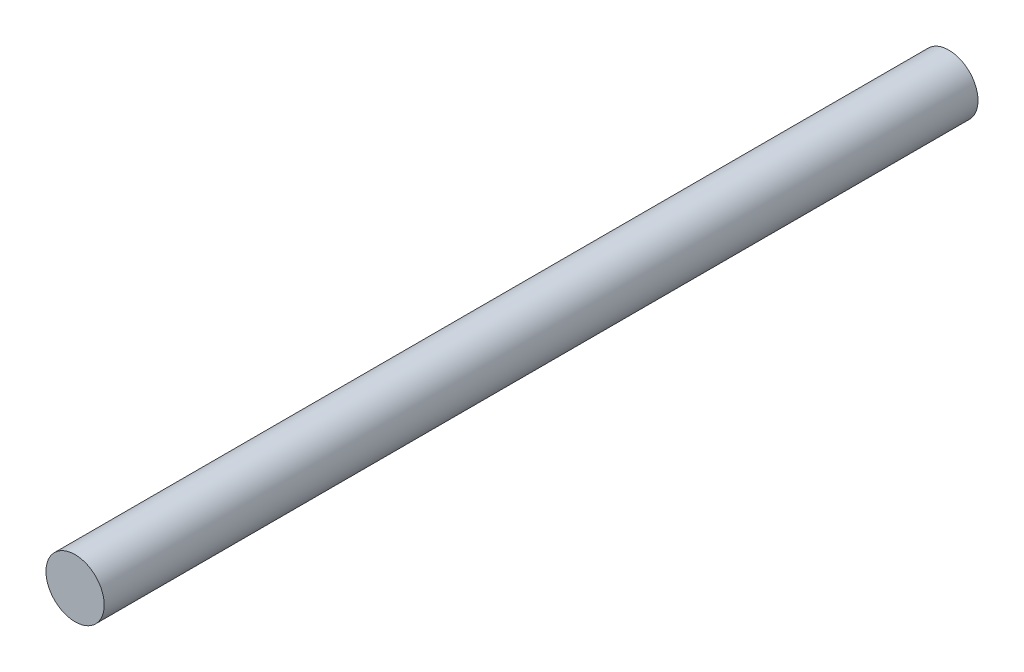
ISO-10303-21;
HEADER;
FILE_DESCRIPTION(('STEP AP214'),'2;1');
FILE_NAME('part.step','',(''),(''),'','','');
FILE_SCHEMA(('AUTOMOTIVE_DESIGN { 1 0 10303 214 1 1 1 1 }'));
ENDSEC;
DATA;
#1=APPLICATION_CONTEXT('core data for automotive mechanical design processes');
#2=APPLICATION_PROTOCOL_DEFINITION('international standard','automotive_design',2000,#1);
#3=PRODUCT_CONTEXT('',#1,'mechanical');
#4=PRODUCT('Part','Part','',(#3));
#5=PRODUCT_RELATED_PRODUCT_CATEGORY('part','',(#4));
#6=PRODUCT_DEFINITION_FORMATION('','',#4);
#7=PRODUCT_DEFINITION_CONTEXT('part definition',#1,'design');
#8=PRODUCT_DEFINITION('design','',#6,#7);
#9=PRODUCT_DEFINITION_SHAPE('','',#8);
#10=(LENGTH_UNIT() NAMED_UNIT(*) SI_UNIT(.MILLI.,.METRE.));
#11=(NAMED_UNIT(*) PLANE_ANGLE_UNIT() SI_UNIT($,.RADIAN.));
#12=(NAMED_UNIT(*) SI_UNIT($,.STERADIAN.) SOLID_ANGLE_UNIT());
#13=UNCERTAINTY_MEASURE_WITH_UNIT(LENGTH_MEASURE(1.E-05),#10,'distance_accuracy_value','');
#14=(GEOMETRIC_REPRESENTATION_CONTEXT(3) GLOBAL_UNCERTAINTY_ASSIGNED_CONTEXT((#13)) GLOBAL_UNIT_ASSIGNED_CONTEXT((#10,
#11,#12)) REPRESENTATION_CONTEXT('',''));
#15=CARTESIAN_POINT('',(0.,0.,0.));
#16=DIRECTION('',(0.,0.,1.));
#17=DIRECTION('',(1.,0.,0.));
#18=AXIS2_PLACEMENT_3D('',#15,#16,#17);
#19=CARTESIAN_POINT('',(0.,0.,750.));
#20=DIRECTION('',(0.,0.,-1.));
#21=DIRECTION('',(-1.,0.,0.));
#22=AXIS2_PLACEMENT_3D('',#19,#20,#21);
#23=CYLINDRICAL_SURFACE('',#22,50.);
#24=CARTESIAN_POINT('',(0.,0.,750.));
#25=DIRECTION('',(0.,0.,1.));
#26=DIRECTION('',(1.,0.,0.));
#27=AXIS2_PLACEMENT_3D('',#24,#25,#26);
#28=CIRCLE('',#27,50.);
#29=CARTESIAN_POINT('',(50.,0.,750.));
#30=VERTEX_POINT('',#29);
#31=EDGE_CURVE('E10',#30,#30,#28,.T.);
#32=ORIENTED_EDGE('',*,*,#31,.F.);
#33=EDGE_LOOP('',(#32));
#34=FACE_BOUND('',#33,.T.);
#35=CARTESIAN_POINT('',(0.,0.,-750.));
#36=DIRECTION('',(0.,0.,1.));
#37=DIRECTION('',(1.,0.,0.));
#38=AXIS2_PLACEMENT_3D('',#35,#36,#37);
#39=CIRCLE('',#38,50.);
#40=CARTESIAN_POINT('',(50.,0.,-750.));
#41=VERTEX_POINT('',#40);
#42=EDGE_CURVE('E36',#41,#41,#39,.T.);
#43=ORIENTED_EDGE('',*,*,#42,.T.);
#44=EDGE_LOOP('',(#43));
#45=FACE_BOUND('',#44,.T.);
#46=ADVANCED_FACE('F33',(#34,#45),#23,.T.);
#47=CARTESIAN_POINT('',(0.,0.,750.));
#48=DIRECTION('',(0.,0.,1.));
#49=DIRECTION('',(1.,0.,0.));
#50=AXIS2_PLACEMENT_3D('',#47,#48,#49);
#51=PLANE('',#50);
#52=ORIENTED_EDGE('',*,*,#31,.T.);
#53=EDGE_LOOP('',(#52));
#54=FACE_BOUND('',#53,.T.);
#55=ADVANCED_FACE('F48',(#54),#51,.T.);
#56=CARTESIAN_POINT('',(0.,0.,-750.));
#57=DIRECTION('',(0.,0.,1.));
#58=DIRECTION('',(1.,0.,0.));
#59=AXIS2_PLACEMENT_3D('',#56,#57,#58);
#60=PLANE('',#59);
#61=ORIENTED_EDGE('',*,*,#42,.F.);
#62=EDGE_LOOP('',(#61));
#63=FACE_BOUND('',#62,.T.);
#64=ADVANCED_FACE('F46',(#63),#60,.F.);
#65=CLOSED_SHELL('',(#46,#55,#64));
#66=MANIFOLD_SOLID_BREP('B2',#65);
#67=ADVANCED_BREP_SHAPE_REPRESENTATION('',(#18,#66),#14);
#68=SHAPE_DEFINITION_REPRESENTATION(#9,#67);
ENDSEC;
END-ISO-10303-21;
